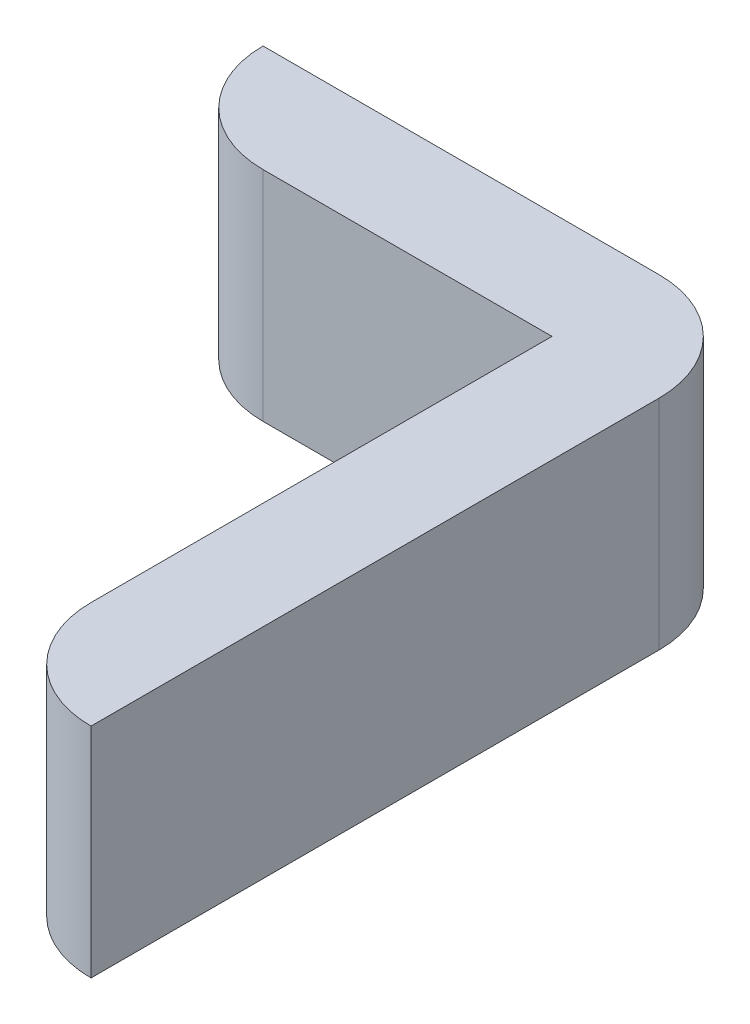
ISO-10303-21;
HEADER;
FILE_DESCRIPTION(('STEP AP214'),'2;1');
FILE_NAME('part.step','',(''),(''),'','','');
FILE_SCHEMA(('AUTOMOTIVE_DESIGN { 1 0 10303 214 1 1 1 1 }'));
ENDSEC;
DATA;
#1=APPLICATION_CONTEXT('core data for automotive mechanical design processes');
#2=APPLICATION_PROTOCOL_DEFINITION('international standard','automotive_design',2000,#1);
#3=PRODUCT_CONTEXT('',#1,'mechanical');
#4=PRODUCT('Part','Part','',(#3));
#5=PRODUCT_RELATED_PRODUCT_CATEGORY('part','',(#4));
#6=PRODUCT_DEFINITION_FORMATION('','',#4);
#7=PRODUCT_DEFINITION_CONTEXT('part definition',#1,'design');
#8=PRODUCT_DEFINITION('design','',#6,#7);
#9=PRODUCT_DEFINITION_SHAPE('','',#8);
#10=(LENGTH_UNIT() NAMED_UNIT(*) SI_UNIT(.MILLI.,.METRE.));
#11=(NAMED_UNIT(*) PLANE_ANGLE_UNIT() SI_UNIT($,.RADIAN.));
#12=(NAMED_UNIT(*) SI_UNIT($,.STERADIAN.) SOLID_ANGLE_UNIT());
#13=UNCERTAINTY_MEASURE_WITH_UNIT(LENGTH_MEASURE(1.E-05),#10,'distance_accuracy_value','');
#14=(GEOMETRIC_REPRESENTATION_CONTEXT(3) GLOBAL_UNCERTAINTY_ASSIGNED_CONTEXT((#13)) GLOBAL_UNIT_ASSIGNED_CONTEXT((#10,
#11,#12)) REPRESENTATION_CONTEXT('',''));
#15=CARTESIAN_POINT('',(0.,0.,0.));
#16=DIRECTION('',(0.,0.,1.));
#17=DIRECTION('',(1.,0.,0.));
#18=AXIS2_PLACEMENT_3D('',#15,#16,#17);
#19=CARTESIAN_POINT('',(9.275,-7.3652,0.));
#20=DIRECTION('',(0.,-1.,0.));
#21=DIRECTION('',(0.,0.,-1.));
#22=AXIS2_PLACEMENT_3D('',#19,#20,#21);
#23=PLANE('',#22);
#24=DIRECTION('',(-1.,0.,0.));
#25=VECTOR('',#24,1.);
#26=CARTESIAN_POINT('',(9.525,-7.3652,0.25));
#27=LINE('',#26,#25);
#28=CARTESIAN_POINT('',(9.525,-7.3652,0.25));
#29=VERTEX_POINT('',#28);
#30=CARTESIAN_POINT('',(10.2,-7.3652,0.25));
#31=VERTEX_POINT('',#30);
#32=EDGE_CURVE('E102',#29,#31,#27,.F.);
#33=ORIENTED_EDGE('',*,*,#32,.T.);
#34=DIRECTION('',(0.,0.,-1.));
#35=VECTOR('',#34,1.);
#36=CARTESIAN_POINT('',(10.2,-7.3652,0.25));
#37=LINE('',#36,#35);
#38=CARTESIAN_POINT('',(10.2,-7.3652,1.327));
#39=VERTEX_POINT('',#38);
#40=EDGE_CURVE('E108',#31,#39,#37,.F.);
#41=ORIENTED_EDGE('',*,*,#40,.T.);
#42=CARTESIAN_POINT('',(10.45,-7.3652,1.327));
#43=DIRECTION('',(0.,-1.,0.));
#44=DIRECTION('',(0.,0.,-1.));
#45=AXIS2_PLACEMENT_3D('',#42,#43,#44);
#46=CIRCLE('',#45,0.25);
#47=CARTESIAN_POINT('',(10.45,-7.3652,1.577));
#48=VERTEX_POINT('',#47);
#49=EDGE_CURVE('E80',#48,#39,#46,.T.);
#50=ORIENTED_EDGE('',*,*,#49,.F.);
#51=DIRECTION('',(0.,0.,1.));
#52=VECTOR('',#51,1.);
#53=CARTESIAN_POINT('',(10.45,-7.3652,1.577));
#54=LINE('',#53,#52);
#55=CARTESIAN_POINT('',(10.45,-7.3652,0.25));
#56=VERTEX_POINT('',#55);
#57=EDGE_CURVE('E75',#48,#56,#54,.F.);
#58=ORIENTED_EDGE('',*,*,#57,.T.);
#59=CARTESIAN_POINT('',(10.2,-7.3652,0.25));
#60=DIRECTION('',(0.,-1.,0.));
#61=DIRECTION('',(0.,0.,-1.));
#62=AXIS2_PLACEMENT_3D('',#59,#60,#61);
#63=CIRCLE('',#62,0.25);
#64=CARTESIAN_POINT('',(10.2,-7.3652,0.));
#65=VERTEX_POINT('',#64);
#66=EDGE_CURVE('E19',#65,#56,#63,.T.);
#67=ORIENTED_EDGE('',*,*,#66,.F.);
#68=DIRECTION('',(1.,0.,0.));
#69=VECTOR('',#68,1.);
#70=CARTESIAN_POINT('',(10.2,-7.3652,0.));
#71=LINE('',#70,#69);
#72=CARTESIAN_POINT('',(9.275,-7.3652,0.));
#73=VERTEX_POINT('',#72);
#74=EDGE_CURVE('E70',#65,#73,#71,.F.);
#75=ORIENTED_EDGE('',*,*,#74,.T.);
#76=CARTESIAN_POINT('',(9.525,-7.3652,0.));
#77=DIRECTION('',(0.,-1.,0.));
#78=DIRECTION('',(0.,0.,-1.));
#79=AXIS2_PLACEMENT_3D('',#76,#77,#78);
#80=CIRCLE('',#79,0.25);
#81=EDGE_CURVE('E121',#29,#73,#80,.T.);
#82=ORIENTED_EDGE('',*,*,#81,.F.);
#83=EDGE_LOOP('',(#33,#41,#50,#58,#67,#75,#82));
#84=FACE_BOUND('',#83,.T.);
#85=ADVANCED_FACE('F16',(#84),#23,.F.);
#86=CARTESIAN_POINT('',(10.2,-7.8748,0.));
#87=DIRECTION('',(0.,0.,1.));
#88=DIRECTION('',(1.,0.,0.));
#89=AXIS2_PLACEMENT_3D('',#86,#87,#88);
#90=PLANE('',#89);
#91=DIRECTION('',(0.,-1.,0.));
#92=VECTOR('',#91,1.);
#93=CARTESIAN_POINT('',(9.275,-7.8748,0.));
#94=LINE('',#93,#92);
#95=CARTESIAN_POINT('',(9.275,-7.8748,0.));
#96=VERTEX_POINT('',#95);
#97=EDGE_CURVE('E123',#73,#96,#94,.T.);
#98=ORIENTED_EDGE('',*,*,#97,.F.);
#99=ORIENTED_EDGE('',*,*,#74,.F.);
#100=DIRECTION('',(0.,-1.,0.));
#101=VECTOR('',#100,1.);
#102=CARTESIAN_POINT('',(10.2,-7.8748,0.));
#103=LINE('',#102,#101);
#104=CARTESIAN_POINT('',(10.2,-7.8748,0.));
#105=VERTEX_POINT('',#104);
#106=EDGE_CURVE('E92',#105,#65,#103,.F.);
#107=ORIENTED_EDGE('',*,*,#106,.F.);
#108=DIRECTION('',(1.,0.,0.));
#109=VECTOR('',#108,1.);
#110=CARTESIAN_POINT('',(9.275,-7.8748,0.));
#111=LINE('',#110,#109);
#112=EDGE_CURVE('E120',#96,#105,#111,.T.);
#113=ORIENTED_EDGE('',*,*,#112,.F.);
#114=EDGE_LOOP('',(#98,#99,#107,#113));
#115=FACE_BOUND('',#114,.T.);
#116=ADVANCED_FACE('F158',(#115),#90,.F.);
#117=CARTESIAN_POINT('',(10.2,-7.8748,0.25));
#118=DIRECTION('',(0.,-1.,0.));
#119=DIRECTION('',(0.,0.,-1.));
#120=AXIS2_PLACEMENT_3D('',#117,#118,#119);
#121=CYLINDRICAL_SURFACE('',#120,0.25);
#122=ORIENTED_EDGE('',*,*,#66,.T.);
#123=DIRECTION('',(0.,1.,0.));
#124=VECTOR('',#123,1.);
#125=CARTESIAN_POINT('',(10.45,-7.8748,0.25));
#126=LINE('',#125,#124);
#127=CARTESIAN_POINT('',(10.45,-7.8748,0.25));
#128=VERTEX_POINT('',#127);
#129=EDGE_CURVE('E86',#56,#128,#126,.F.);
#130=ORIENTED_EDGE('',*,*,#129,.T.);
#131=CARTESIAN_POINT('',(10.2,-7.8748,0.25));
#132=DIRECTION('',(0.,-1.,0.));
#133=DIRECTION('',(0.,0.,-1.));
#134=AXIS2_PLACEMENT_3D('',#131,#132,#133);
#135=CIRCLE('',#134,0.25);
#136=EDGE_CURVE('E118',#105,#128,#135,.T.);
#137=ORIENTED_EDGE('',*,*,#136,.F.);
#138=ORIENTED_EDGE('',*,*,#106,.T.);
#139=EDGE_LOOP('',(#122,#130,#137,#138));
#140=FACE_BOUND('',#139,.T.);
#141=ADVANCED_FACE('F89',(#140),#121,.T.);
#142=CARTESIAN_POINT('',(10.45,-7.8748,1.577));
#143=DIRECTION('',(-1.,0.,0.));
#144=DIRECTION('',(0.,0.,1.));
#145=AXIS2_PLACEMENT_3D('',#142,#143,#144);
#146=PLANE('',#145);
#147=DIRECTION('',(0.,-1.,0.));
#148=VECTOR('',#147,1.);
#149=CARTESIAN_POINT('',(10.45,-7.8748,1.577));
#150=LINE('',#149,#148);
#151=CARTESIAN_POINT('',(10.45,-7.8748,1.577));
#152=VERTEX_POINT('',#151);
#153=EDGE_CURVE('E85',#152,#48,#150,.F.);
#154=ORIENTED_EDGE('',*,*,#153,.F.);
#155=DIRECTION('',(0.,0.,-1.));
#156=VECTOR('',#155,1.);
#157=CARTESIAN_POINT('',(10.45,-7.8748,0.));
#158=LINE('',#157,#156);
#159=EDGE_CURVE('E94',#128,#152,#158,.F.);
#160=ORIENTED_EDGE('',*,*,#159,.F.);
#161=ORIENTED_EDGE('',*,*,#129,.F.);
#162=ORIENTED_EDGE('',*,*,#57,.F.);
#163=EDGE_LOOP('',(#154,#160,#161,#162));
#164=FACE_BOUND('',#163,.T.);
#165=ADVANCED_FACE('F93',(#164),#146,.F.);
#166=CARTESIAN_POINT('',(10.45,-7.8748,1.327));
#167=DIRECTION('',(0.,-1.,0.));
#168=DIRECTION('',(0.,0.,-1.));
#169=AXIS2_PLACEMENT_3D('',#166,#167,#168);
#170=CYLINDRICAL_SURFACE('',#169,0.25);
#171=ORIENTED_EDGE('',*,*,#49,.T.);
#172=DIRECTION('',(0.,1.,0.));
#173=VECTOR('',#172,1.);
#174=CARTESIAN_POINT('',(10.2,-7.8748,1.327));
#175=LINE('',#174,#173);
#176=CARTESIAN_POINT('',(10.2,-7.8748,1.327));
#177=VERTEX_POINT('',#176);
#178=EDGE_CURVE('E105',#39,#177,#175,.F.);
#179=ORIENTED_EDGE('',*,*,#178,.T.);
#180=CARTESIAN_POINT('',(10.45,-7.8748,1.327));
#181=DIRECTION('',(0.,-1.,0.));
#182=DIRECTION('',(0.,0.,-1.));
#183=AXIS2_PLACEMENT_3D('',#180,#181,#182);
#184=CIRCLE('',#183,0.25);
#185=EDGE_CURVE('E114',#152,#177,#184,.T.);
#186=ORIENTED_EDGE('',*,*,#185,.F.);
#187=ORIENTED_EDGE('',*,*,#153,.T.);
#188=EDGE_LOOP('',(#171,#179,#186,#187));
#189=FACE_BOUND('',#188,.T.);
#190=ADVANCED_FACE('F127',(#189),#170,.T.);
#191=CARTESIAN_POINT('',(10.2,-7.8748,0.25));
#192=DIRECTION('',(1.,0.,0.));
#193=DIRECTION('',(0.,0.,-1.));
#194=AXIS2_PLACEMENT_3D('',#191,#192,#193);
#195=PLANE('',#194);
#196=ORIENTED_EDGE('',*,*,#178,.F.);
#197=ORIENTED_EDGE('',*,*,#40,.F.);
#198=DIRECTION('',(0.,1.,0.));
#199=VECTOR('',#198,1.);
#200=CARTESIAN_POINT('',(10.2,-7.8748,0.25));
#201=LINE('',#200,#199);
#202=CARTESIAN_POINT('',(10.2,-7.8748,0.25));
#203=VERTEX_POINT('',#202);
#204=EDGE_CURVE('E104',#31,#203,#201,.F.);
#205=ORIENTED_EDGE('',*,*,#204,.T.);
#206=DIRECTION('',(0.,0.,-1.));
#207=VECTOR('',#206,1.);
#208=CARTESIAN_POINT('',(10.2,-7.8748,0.));
#209=LINE('',#208,#207);
#210=EDGE_CURVE('E117',#177,#203,#209,.T.);
#211=ORIENTED_EDGE('',*,*,#210,.F.);
#212=EDGE_LOOP('',(#196,#197,#205,#211));
#213=FACE_BOUND('',#212,.T.);
#214=ADVANCED_FACE('F150',(#213),#195,.F.);
#215=CARTESIAN_POINT('',(9.525,-7.8748,0.25));
#216=DIRECTION('',(0.,0.,-1.));
#217=DIRECTION('',(-1.,0.,0.));
#218=AXIS2_PLACEMENT_3D('',#215,#216,#217);
#219=PLANE('',#218);
#220=ORIENTED_EDGE('',*,*,#204,.F.);
#221=ORIENTED_EDGE('',*,*,#32,.F.);
#222=DIRECTION('',(0.,-1.,0.));
#223=VECTOR('',#222,1.);
#224=CARTESIAN_POINT('',(9.525,-7.8748,0.25));
#225=LINE('',#224,#223);
#226=CARTESIAN_POINT('',(9.525,-7.8748,0.25));
#227=VERTEX_POINT('',#226);
#228=EDGE_CURVE('E34',#227,#29,#225,.F.);
#229=ORIENTED_EDGE('',*,*,#228,.F.);
#230=DIRECTION('',(1.,0.,0.));
#231=VECTOR('',#230,1.);
#232=CARTESIAN_POINT('',(9.275,-7.8748,0.25));
#233=LINE('',#232,#231);
#234=EDGE_CURVE('E25',#203,#227,#233,.F.);
#235=ORIENTED_EDGE('',*,*,#234,.F.);
#236=EDGE_LOOP('',(#220,#221,#229,#235));
#237=FACE_BOUND('',#236,.T.);
#238=ADVANCED_FACE('F151',(#237),#219,.F.);
#239=CARTESIAN_POINT('',(9.525,-7.8748,0.));
#240=DIRECTION('',(0.,-1.,0.));
#241=DIRECTION('',(0.,0.,-1.));
#242=AXIS2_PLACEMENT_3D('',#239,#240,#241);
#243=CYLINDRICAL_SURFACE('',#242,0.25);
#244=ORIENTED_EDGE('',*,*,#81,.T.);
#245=ORIENTED_EDGE('',*,*,#97,.T.);
#246=CARTESIAN_POINT('',(9.525,-7.8748,0.));
#247=DIRECTION('',(0.,-1.,0.));
#248=DIRECTION('',(0.,0.,-1.));
#249=AXIS2_PLACEMENT_3D('',#246,#247,#248);
#250=CIRCLE('',#249,0.25);
#251=EDGE_CURVE('E11',#227,#96,#250,.T.);
#252=ORIENTED_EDGE('',*,*,#251,.F.);
#253=ORIENTED_EDGE('',*,*,#228,.T.);
#254=EDGE_LOOP('',(#244,#245,#252,#253));
#255=FACE_BOUND('',#254,.T.);
#256=ADVANCED_FACE('F156',(#255),#243,.T.);
#257=CARTESIAN_POINT('',(9.275,-7.8748,0.));
#258=DIRECTION('',(0.,-1.,0.));
#259=DIRECTION('',(0.,0.,-1.));
#260=AXIS2_PLACEMENT_3D('',#257,#258,#259);
#261=PLANE('',#260);
#262=ORIENTED_EDGE('',*,*,#234,.T.);
#263=ORIENTED_EDGE('',*,*,#251,.T.);
#264=ORIENTED_EDGE('',*,*,#112,.T.);
#265=ORIENTED_EDGE('',*,*,#136,.T.);
#266=ORIENTED_EDGE('',*,*,#159,.T.);
#267=ORIENTED_EDGE('',*,*,#185,.T.);
#268=ORIENTED_EDGE('',*,*,#210,.T.);
#269=EDGE_LOOP('',(#262,#263,#264,#265,#266,#267,#268));
#270=FACE_BOUND('',#269,.T.);
#271=ADVANCED_FACE('F132',(#270),#261,.T.);
#272=CLOSED_SHELL('',(#85,#116,#141,#165,#190,#214,#238,#256,#271));
#273=MANIFOLD_SOLID_BREP('B1',#272);
#274=ADVANCED_BREP_SHAPE_REPRESENTATION('',(#18,#273),#14);
#275=SHAPE_DEFINITION_REPRESENTATION(#9,#274);
ENDSEC;
END-ISO-10303-21;
